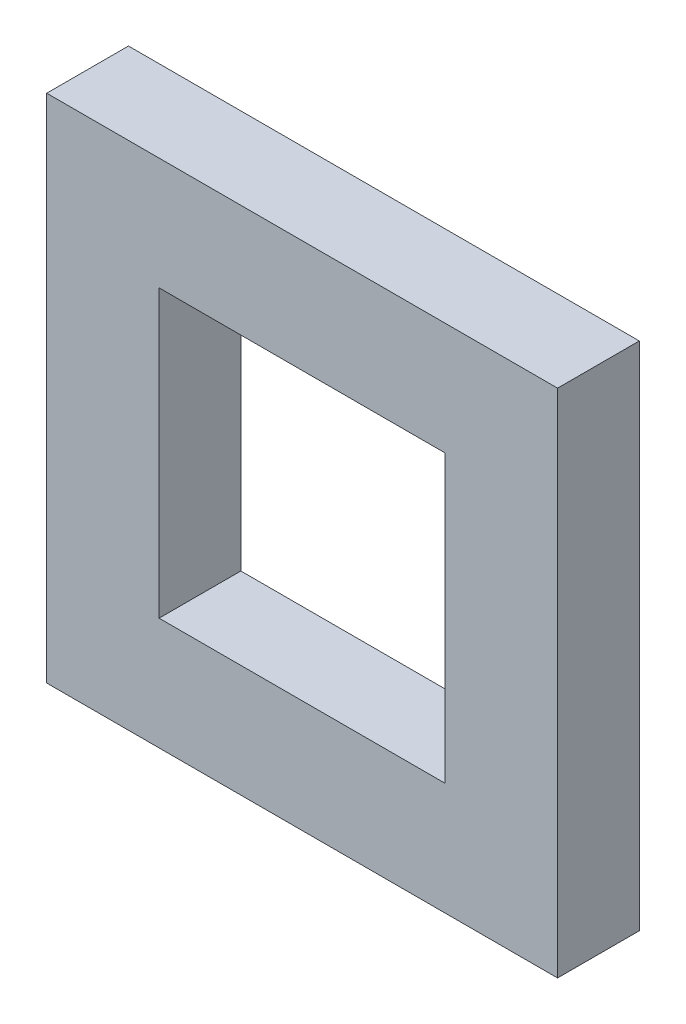
ISO-10303-21;
HEADER;
FILE_DESCRIPTION(('STEP AP214'),'2;1');
FILE_NAME('part.step','',(''),(''),'','','');
FILE_SCHEMA(('AUTOMOTIVE_DESIGN { 1 0 10303 214 1 1 1 1 }'));
ENDSEC;
DATA;
#1=APPLICATION_CONTEXT('core data for automotive mechanical design processes');
#2=APPLICATION_PROTOCOL_DEFINITION('international standard','automotive_design',2000,#1);
#3=PRODUCT_CONTEXT('',#1,'mechanical');
#4=PRODUCT('Part','Part','',(#3));
#5=PRODUCT_RELATED_PRODUCT_CATEGORY('part','',(#4));
#6=PRODUCT_DEFINITION_FORMATION('','',#4);
#7=PRODUCT_DEFINITION_CONTEXT('part definition',#1,'design');
#8=PRODUCT_DEFINITION('design','',#6,#7);
#9=PRODUCT_DEFINITION_SHAPE('','',#8);
#10=(LENGTH_UNIT() NAMED_UNIT(*) SI_UNIT(.MILLI.,.METRE.));
#11=(NAMED_UNIT(*) PLANE_ANGLE_UNIT() SI_UNIT($,.RADIAN.));
#12=(NAMED_UNIT(*) SI_UNIT($,.STERADIAN.) SOLID_ANGLE_UNIT());
#13=UNCERTAINTY_MEASURE_WITH_UNIT(LENGTH_MEASURE(1.E-05),#10,'distance_accuracy_value','');
#14=(GEOMETRIC_REPRESENTATION_CONTEXT(3) GLOBAL_UNCERTAINTY_ASSIGNED_CONTEXT((#13)) GLOBAL_UNIT_ASSIGNED_CONTEXT((#10,
#11,#12)) REPRESENTATION_CONTEXT('',''));
#15=CARTESIAN_POINT('',(0.,0.,0.));
#16=DIRECTION('',(0.,0.,1.));
#17=DIRECTION('',(1.,0.,0.));
#18=AXIS2_PLACEMENT_3D('',#15,#16,#17);
#19=CARTESIAN_POINT('',(317.5,-317.5,101.6));
#20=DIRECTION('',(0.,-1.,0.));
#21=DIRECTION('',(1.,0.,0.));
#22=AXIS2_PLACEMENT_3D('',#19,#20,#21);
#23=PLANE('',#22);
#24=DIRECTION('',(-1.,0.,0.));
#25=VECTOR('',#24,1.);
#26=CARTESIAN_POINT('',(317.5,-317.5,0.));
#27=LINE('',#26,#25);
#28=CARTESIAN_POINT('',(317.5,-317.5,0.));
#29=VERTEX_POINT('',#28);
#30=CARTESIAN_POINT('',(-317.5,-317.5,0.));
#31=VERTEX_POINT('',#30);
#32=EDGE_CURVE('E131',#29,#31,#27,.T.);
#33=ORIENTED_EDGE('',*,*,#32,.F.);
#34=DIRECTION('',(0.,0.,-1.));
#35=VECTOR('',#34,1.);
#36=CARTESIAN_POINT('',(317.5,-317.5,101.6));
#37=LINE('',#36,#35);
#38=CARTESIAN_POINT('',(317.5,-317.5,101.6));
#39=VERTEX_POINT('',#38);
#40=EDGE_CURVE('E11',#39,#29,#37,.T.);
#41=ORIENTED_EDGE('',*,*,#40,.F.);
#42=DIRECTION('',(-1.,0.,0.));
#43=VECTOR('',#42,1.);
#44=CARTESIAN_POINT('',(317.5,-317.5,101.6));
#45=LINE('',#44,#43);
#46=CARTESIAN_POINT('',(-317.5,-317.5,101.6));
#47=VERTEX_POINT('',#46);
#48=EDGE_CURVE('E135',#39,#47,#45,.T.);
#49=ORIENTED_EDGE('',*,*,#48,.T.);
#50=DIRECTION('',(0.,0.,-1.));
#51=VECTOR('',#50,1.);
#52=CARTESIAN_POINT('',(-317.5,-317.5,101.6));
#53=LINE('',#52,#51);
#54=EDGE_CURVE('E36',#47,#31,#53,.T.);
#55=ORIENTED_EDGE('',*,*,#54,.T.);
#56=EDGE_LOOP('',(#33,#41,#49,#55));
#57=FACE_BOUND('',#56,.T.);
#58=ADVANCED_FACE('F33',(#57),#23,.T.);
#59=CARTESIAN_POINT('',(317.5,-317.5,101.6));
#60=DIRECTION('',(-1.,0.,0.));
#61=DIRECTION('',(0.,0.,1.));
#62=AXIS2_PLACEMENT_3D('',#59,#60,#61);
#63=PLANE('',#62);
#64=DIRECTION('',(0.,1.,0.));
#65=VECTOR('',#64,1.);
#66=CARTESIAN_POINT('',(317.5,-317.5,0.));
#67=LINE('',#66,#65);
#68=CARTESIAN_POINT('',(317.5,317.5,0.));
#69=VERTEX_POINT('',#68);
#70=EDGE_CURVE('E139',#29,#69,#67,.T.);
#71=ORIENTED_EDGE('',*,*,#70,.T.);
#72=DIRECTION('',(0.,0.,-1.));
#73=VECTOR('',#72,1.);
#74=CARTESIAN_POINT('',(317.5,317.5,101.6));
#75=LINE('',#74,#73);
#76=CARTESIAN_POINT('',(317.5,317.5,101.6));
#77=VERTEX_POINT('',#76);
#78=EDGE_CURVE('E41',#77,#69,#75,.T.);
#79=ORIENTED_EDGE('',*,*,#78,.F.);
#80=DIRECTION('',(0.,1.,0.));
#81=VECTOR('',#80,1.);
#82=CARTESIAN_POINT('',(317.5,-317.5,101.6));
#83=LINE('',#82,#81);
#84=EDGE_CURVE('E144',#39,#77,#83,.T.);
#85=ORIENTED_EDGE('',*,*,#84,.F.);
#86=ORIENTED_EDGE('',*,*,#40,.T.);
#87=EDGE_LOOP('',(#71,#79,#85,#86));
#88=FACE_BOUND('',#87,.T.);
#89=ADVANCED_FACE('F169',(#88),#63,.F.);
#90=CARTESIAN_POINT('',(317.5,317.5,101.6));
#91=DIRECTION('',(0.,-1.,0.));
#92=DIRECTION('',(1.,0.,0.));
#93=AXIS2_PLACEMENT_3D('',#90,#91,#92);
#94=PLANE('',#93);
#95=DIRECTION('',(-1.,0.,0.));
#96=VECTOR('',#95,1.);
#97=CARTESIAN_POINT('',(317.5,317.5,0.));
#98=LINE('',#97,#96);
#99=CARTESIAN_POINT('',(-317.5,317.5,0.));
#100=VERTEX_POINT('',#99);
#101=EDGE_CURVE('E151',#69,#100,#98,.T.);
#102=ORIENTED_EDGE('',*,*,#101,.T.);
#103=DIRECTION('',(0.,0.,-1.));
#104=VECTOR('',#103,1.);
#105=CARTESIAN_POINT('',(-317.5,317.5,101.6));
#106=LINE('',#105,#104);
#107=CARTESIAN_POINT('',(-317.5,317.5,101.6));
#108=VERTEX_POINT('',#107);
#109=EDGE_CURVE('E156',#108,#100,#106,.T.);
#110=ORIENTED_EDGE('',*,*,#109,.F.);
#111=DIRECTION('',(-1.,0.,0.));
#112=VECTOR('',#111,1.);
#113=CARTESIAN_POINT('',(317.5,317.5,101.6));
#114=LINE('',#113,#112);
#115=EDGE_CURVE('E142',#77,#108,#114,.T.);
#116=ORIENTED_EDGE('',*,*,#115,.F.);
#117=ORIENTED_EDGE('',*,*,#78,.T.);
#118=EDGE_LOOP('',(#102,#110,#116,#117));
#119=FACE_BOUND('',#118,.T.);
#120=ADVANCED_FACE('F173',(#119),#94,.F.);
#121=CARTESIAN_POINT('',(-317.5,-317.5,101.6));
#122=DIRECTION('',(-1.,0.,0.));
#123=DIRECTION('',(0.,0.,1.));
#124=AXIS2_PLACEMENT_3D('',#121,#122,#123);
#125=PLANE('',#124);
#126=DIRECTION('',(0.,1.,0.));
#127=VECTOR('',#126,1.);
#128=CARTESIAN_POINT('',(-317.5,-317.5,0.));
#129=LINE('',#128,#127);
#130=EDGE_CURVE('E148',#31,#100,#129,.T.);
#131=ORIENTED_EDGE('',*,*,#130,.F.);
#132=ORIENTED_EDGE('',*,*,#54,.F.);
#133=DIRECTION('',(0.,1.,0.));
#134=VECTOR('',#133,1.);
#135=CARTESIAN_POINT('',(-317.5,-317.5,101.6));
#136=LINE('',#135,#134);
#137=EDGE_CURVE('E138',#47,#108,#136,.T.);
#138=ORIENTED_EDGE('',*,*,#137,.T.);
#139=ORIENTED_EDGE('',*,*,#109,.T.);
#140=EDGE_LOOP('',(#131,#132,#138,#139));
#141=FACE_BOUND('',#140,.T.);
#142=ADVANCED_FACE('F164',(#141),#125,.T.);
#143=CARTESIAN_POINT('',(0.,0.,101.6));
#144=DIRECTION('',(0.,0.,-1.));
#145=DIRECTION('',(-1.,0.,0.));
#146=AXIS2_PLACEMENT_3D('',#143,#144,#145);
#147=PLANE('',#146);
#148=DIRECTION('',(1.,0.,0.));
#149=VECTOR('',#148,1.);
#150=CARTESIAN_POINT('',(177.8,-177.8,101.6));
#151=LINE('',#150,#149);
#152=CARTESIAN_POINT('',(-177.8,-177.8,101.6));
#153=VERTEX_POINT('',#152);
#154=CARTESIAN_POINT('',(177.8,-177.8,101.6));
#155=VERTEX_POINT('',#154);
#156=EDGE_CURVE('E125',#153,#155,#151,.T.);
#157=ORIENTED_EDGE('',*,*,#156,.F.);
#158=DIRECTION('',(0.,-1.,0.));
#159=VECTOR('',#158,1.);
#160=CARTESIAN_POINT('',(-177.8,-177.8,101.6));
#161=LINE('',#160,#159);
#162=CARTESIAN_POINT('',(-177.8,177.8,101.6));
#163=VERTEX_POINT('',#162);
#164=EDGE_CURVE('E49',#163,#153,#161,.T.);
#165=ORIENTED_EDGE('',*,*,#164,.F.);
#166=DIRECTION('',(-1.,0.,0.));
#167=VECTOR('',#166,1.);
#168=CARTESIAN_POINT('',(177.8,177.8,101.6));
#169=LINE('',#168,#167);
#170=CARTESIAN_POINT('',(177.8,177.8,101.6));
#171=VERTEX_POINT('',#170);
#172=EDGE_CURVE('E116',#171,#163,#169,.T.);
#173=ORIENTED_EDGE('',*,*,#172,.F.);
#174=DIRECTION('',(0.,1.,0.));
#175=VECTOR('',#174,1.);
#176=CARTESIAN_POINT('',(177.8,-177.8,101.6));
#177=LINE('',#176,#175);
#178=EDGE_CURVE('E119',#155,#171,#177,.T.);
#179=ORIENTED_EDGE('',*,*,#178,.F.);
#180=EDGE_LOOP('',(#157,#165,#173,#179));
#181=FACE_BOUND('',#180,.T.);
#182=ORIENTED_EDGE('',*,*,#48,.F.);
#183=ORIENTED_EDGE('',*,*,#84,.T.);
#184=ORIENTED_EDGE('',*,*,#115,.T.);
#185=ORIENTED_EDGE('',*,*,#137,.F.);
#186=EDGE_LOOP('',(#182,#183,#184,#185));
#187=FACE_BOUND('',#186,.T.);
#188=ADVANCED_FACE('F175',(#181,#187),#147,.F.);
#189=CARTESIAN_POINT('',(0.,0.,0.));
#190=DIRECTION('',(0.,0.,-1.));
#191=DIRECTION('',(-1.,0.,0.));
#192=AXIS2_PLACEMENT_3D('',#189,#190,#191);
#193=PLANE('',#192);
#194=DIRECTION('',(0.,-1.,0.));
#195=VECTOR('',#194,1.);
#196=CARTESIAN_POINT('',(-177.8,-177.8,0.));
#197=LINE('',#196,#195);
#198=CARTESIAN_POINT('',(-177.8,177.8,0.));
#199=VERTEX_POINT('',#198);
#200=CARTESIAN_POINT('',(-177.8,-177.8,0.));
#201=VERTEX_POINT('',#200);
#202=EDGE_CURVE('E100',#199,#201,#197,.T.);
#203=ORIENTED_EDGE('',*,*,#202,.T.);
#204=DIRECTION('',(1.,0.,0.));
#205=VECTOR('',#204,1.);
#206=CARTESIAN_POINT('',(177.8,-177.8,0.));
#207=LINE('',#206,#205);
#208=CARTESIAN_POINT('',(177.8,-177.8,0.));
#209=VERTEX_POINT('',#208);
#210=EDGE_CURVE('E109',#201,#209,#207,.T.);
#211=ORIENTED_EDGE('',*,*,#210,.T.);
#212=DIRECTION('',(0.,1.,0.));
#213=VECTOR('',#212,1.);
#214=CARTESIAN_POINT('',(177.8,-177.8,0.));
#215=LINE('',#214,#213);
#216=CARTESIAN_POINT('',(177.8,177.8,0.));
#217=VERTEX_POINT('',#216);
#218=EDGE_CURVE('E57',#209,#217,#215,.T.);
#219=ORIENTED_EDGE('',*,*,#218,.T.);
#220=DIRECTION('',(-1.,0.,0.));
#221=VECTOR('',#220,1.);
#222=CARTESIAN_POINT('',(177.8,177.8,0.));
#223=LINE('',#222,#221);
#224=EDGE_CURVE('E106',#217,#199,#223,.T.);
#225=ORIENTED_EDGE('',*,*,#224,.T.);
#226=EDGE_LOOP('',(#203,#211,#219,#225));
#227=FACE_BOUND('',#226,.T.);
#228=ORIENTED_EDGE('',*,*,#32,.T.);
#229=ORIENTED_EDGE('',*,*,#130,.T.);
#230=ORIENTED_EDGE('',*,*,#101,.F.);
#231=ORIENTED_EDGE('',*,*,#70,.F.);
#232=EDGE_LOOP('',(#228,#229,#230,#231));
#233=FACE_BOUND('',#232,.T.);
#234=ADVANCED_FACE('F113',(#227,#233),#193,.T.);
#235=CARTESIAN_POINT('',(-177.8,-177.8,0.));
#236=DIRECTION('',(-1.,0.,0.));
#237=DIRECTION('',(0.,0.,1.));
#238=AXIS2_PLACEMENT_3D('',#235,#236,#237);
#239=PLANE('',#238);
#240=ORIENTED_EDGE('',*,*,#164,.T.);
#241=DIRECTION('',(0.,0.,1.));
#242=VECTOR('',#241,1.);
#243=CARTESIAN_POINT('',(-177.8,-177.8,0.));
#244=LINE('',#243,#242);
#245=EDGE_CURVE('E96',#201,#153,#244,.T.);
#246=ORIENTED_EDGE('',*,*,#245,.F.);
#247=ORIENTED_EDGE('',*,*,#202,.F.);
#248=DIRECTION('',(0.,0.,1.));
#249=VECTOR('',#248,1.);
#250=CARTESIAN_POINT('',(-177.8,177.8,0.));
#251=LINE('',#250,#249);
#252=EDGE_CURVE('E129',#199,#163,#251,.T.);
#253=ORIENTED_EDGE('',*,*,#252,.T.);
#254=EDGE_LOOP('',(#240,#246,#247,#253));
#255=FACE_BOUND('',#254,.T.);
#256=ADVANCED_FACE('F98',(#255),#239,.F.);
#257=CARTESIAN_POINT('',(177.8,177.8,0.));
#258=DIRECTION('',(0.,1.,0.));
#259=DIRECTION('',(-1.,0.,0.));
#260=AXIS2_PLACEMENT_3D('',#257,#258,#259);
#261=PLANE('',#260);
#262=ORIENTED_EDGE('',*,*,#172,.T.);
#263=ORIENTED_EDGE('',*,*,#252,.F.);
#264=ORIENTED_EDGE('',*,*,#224,.F.);
#265=DIRECTION('',(0.,0.,1.));
#266=VECTOR('',#265,1.);
#267=CARTESIAN_POINT('',(177.8,177.8,0.));
#268=LINE('',#267,#266);
#269=EDGE_CURVE('E132',#217,#171,#268,.T.);
#270=ORIENTED_EDGE('',*,*,#269,.T.);
#271=EDGE_LOOP('',(#262,#263,#264,#270));
#272=FACE_BOUND('',#271,.T.);
#273=ADVANCED_FACE('F219',(#272),#261,.F.);
#274=CARTESIAN_POINT('',(177.8,-177.8,0.));
#275=DIRECTION('',(1.,0.,0.));
#276=DIRECTION('',(0.,0.,-1.));
#277=AXIS2_PLACEMENT_3D('',#274,#275,#276);
#278=PLANE('',#277);
#279=ORIENTED_EDGE('',*,*,#178,.T.);
#280=ORIENTED_EDGE('',*,*,#269,.F.);
#281=ORIENTED_EDGE('',*,*,#218,.F.);
#282=DIRECTION('',(0.,0.,1.));
#283=VECTOR('',#282,1.);
#284=CARTESIAN_POINT('',(177.8,-177.8,0.));
#285=LINE('',#284,#283);
#286=EDGE_CURVE('E105',#209,#155,#285,.T.);
#287=ORIENTED_EDGE('',*,*,#286,.T.);
#288=EDGE_LOOP('',(#279,#280,#281,#287));
#289=FACE_BOUND('',#288,.T.);
#290=ADVANCED_FACE('F227',(#289),#278,.F.);
#291=CARTESIAN_POINT('',(177.8,-177.8,0.));
#292=DIRECTION('',(0.,-1.,0.));
#293=DIRECTION('',(0.,0.,-1.));
#294=AXIS2_PLACEMENT_3D('',#291,#292,#293);
#295=PLANE('',#294);
#296=ORIENTED_EDGE('',*,*,#156,.T.);
#297=ORIENTED_EDGE('',*,*,#286,.F.);
#298=ORIENTED_EDGE('',*,*,#210,.F.);
#299=ORIENTED_EDGE('',*,*,#245,.T.);
#300=EDGE_LOOP('',(#296,#297,#298,#299));
#301=FACE_BOUND('',#300,.T.);
#302=ADVANCED_FACE('F110',(#301),#295,.F.);
#303=CLOSED_SHELL('',(#58,#89,#120,#142,#188,#234,#256,#273,#290,#302));
#304=MANIFOLD_SOLID_BREP('B2',#303);
#305=ADVANCED_BREP_SHAPE_REPRESENTATION('',(#18,#304),#14);
#306=SHAPE_DEFINITION_REPRESENTATION(#9,#305);
ENDSEC;
END-ISO-10303-21;
